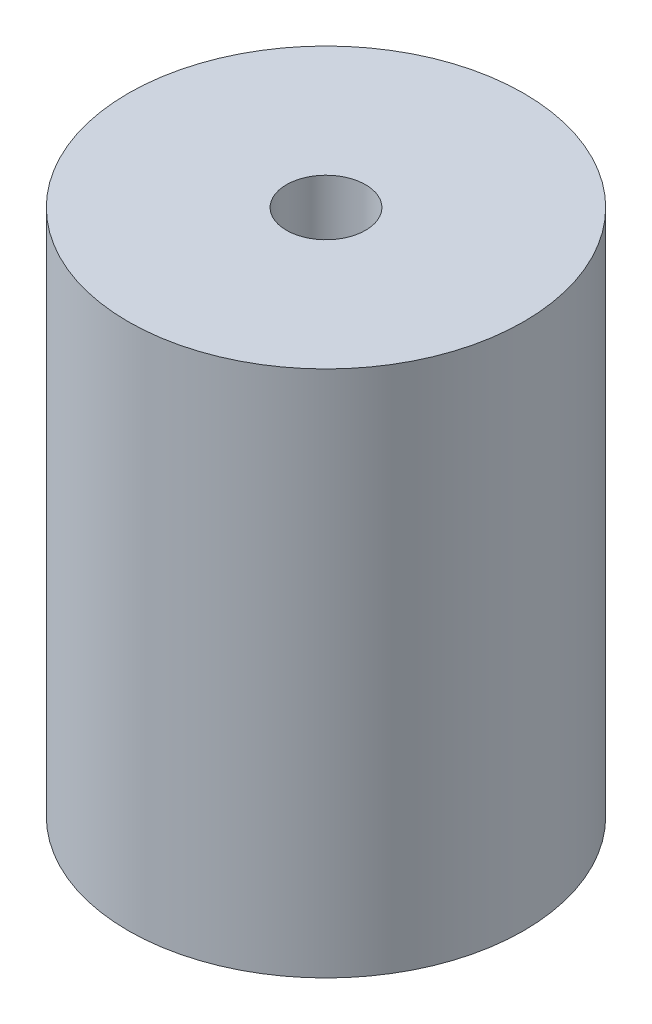
ISO-10303-21;
HEADER;
FILE_DESCRIPTION(('STEP AP214'),'2;1');
FILE_NAME('part.step','',(''),(''),'','','');
FILE_SCHEMA(('AUTOMOTIVE_DESIGN { 1 0 10303 214 1 1 1 1 }'));
ENDSEC;
DATA;
#1=APPLICATION_CONTEXT('core data for automotive mechanical design processes');
#2=APPLICATION_PROTOCOL_DEFINITION('international standard','automotive_design',2000,#1);
#3=PRODUCT_CONTEXT('',#1,'mechanical');
#4=PRODUCT('Part','Part','',(#3));
#5=PRODUCT_RELATED_PRODUCT_CATEGORY('part','',(#4));
#6=PRODUCT_DEFINITION_FORMATION('','',#4);
#7=PRODUCT_DEFINITION_CONTEXT('part definition',#1,'design');
#8=PRODUCT_DEFINITION('design','',#6,#7);
#9=PRODUCT_DEFINITION_SHAPE('','',#8);
#10=(LENGTH_UNIT() NAMED_UNIT(*) SI_UNIT(.MILLI.,.METRE.));
#11=(NAMED_UNIT(*) PLANE_ANGLE_UNIT() SI_UNIT($,.RADIAN.));
#12=(NAMED_UNIT(*) SI_UNIT($,.STERADIAN.) SOLID_ANGLE_UNIT());
#13=UNCERTAINTY_MEASURE_WITH_UNIT(LENGTH_MEASURE(1.E-05),#10,'distance_accuracy_value','');
#14=(GEOMETRIC_REPRESENTATION_CONTEXT(3) GLOBAL_UNCERTAINTY_ASSIGNED_CONTEXT((#13)) GLOBAL_UNIT_ASSIGNED_CONTEXT((#10,
#11,#12)) REPRESENTATION_CONTEXT('',''));
#15=CARTESIAN_POINT('',(0.,0.,0.));
#16=DIRECTION('',(0.,0.,1.));
#17=DIRECTION('',(1.,0.,0.));
#18=AXIS2_PLACEMENT_3D('',#15,#16,#17);
#19=CARTESIAN_POINT('',(0.,40.,0.));
#20=DIRECTION('',(0.,-1.,0.));
#21=DIRECTION('',(0.,0.,-1.));
#22=AXIS2_PLACEMENT_3D('',#19,#20,#21);
#23=CYLINDRICAL_SURFACE('',#22,15.);
#24=CARTESIAN_POINT('',(0.,40.,0.));
#25=DIRECTION('',(0.,1.,0.));
#26=DIRECTION('',(0.,0.,1.));
#27=AXIS2_PLACEMENT_3D('',#24,#25,#26);
#28=CIRCLE('',#27,15.);
#29=CARTESIAN_POINT('',(0.,40.,15.));
#30=VERTEX_POINT('',#29);
#31=EDGE_CURVE('E10',#30,#30,#28,.T.);
#32=ORIENTED_EDGE('',*,*,#31,.F.);
#33=EDGE_LOOP('',(#32));
#34=FACE_BOUND('',#33,.T.);
#35=CARTESIAN_POINT('',(0.,0.,0.));
#36=DIRECTION('',(0.,1.,0.));
#37=DIRECTION('',(0.,0.,1.));
#38=AXIS2_PLACEMENT_3D('',#35,#36,#37);
#39=CIRCLE('',#38,15.);
#40=CARTESIAN_POINT('',(0.,0.,15.));
#41=VERTEX_POINT('',#40);
#42=EDGE_CURVE('E32',#41,#41,#39,.T.);
#43=ORIENTED_EDGE('',*,*,#42,.T.);
#44=EDGE_LOOP('',(#43));
#45=FACE_BOUND('',#44,.T.);
#46=ADVANCED_FACE('F29',(#34,#45),#23,.T.);
#47=CARTESIAN_POINT('',(0.,40.,0.));
#48=DIRECTION('',(0.,1.,0.));
#49=DIRECTION('',(0.,0.,1.));
#50=AXIS2_PLACEMENT_3D('',#47,#48,#49);
#51=PLANE('',#50);
#52=CARTESIAN_POINT('',(0.,40.,0.));
#53=DIRECTION('',(0.,1.,0.));
#54=DIRECTION('',(0.,0.,1.));
#55=AXIS2_PLACEMENT_3D('',#52,#53,#54);
#56=CIRCLE('',#55,3.);
#57=CARTESIAN_POINT('',(0.,40.,3.));
#58=VERTEX_POINT('',#57);
#59=EDGE_CURVE('E39',#58,#58,#56,.T.);
#60=ORIENTED_EDGE('',*,*,#59,.F.);
#61=EDGE_LOOP('',(#60));
#62=FACE_BOUND('',#61,.T.);
#63=ORIENTED_EDGE('',*,*,#31,.T.);
#64=EDGE_LOOP('',(#63));
#65=FACE_BOUND('',#64,.T.);
#66=ADVANCED_FACE('F66',(#62,#65),#51,.T.);
#67=CARTESIAN_POINT('',(0.,0.,0.));
#68=DIRECTION('',(0.,1.,0.));
#69=DIRECTION('',(0.,0.,1.));
#70=AXIS2_PLACEMENT_3D('',#67,#68,#69);
#71=PLANE('',#70);
#72=CARTESIAN_POINT('',(0.,0.,0.));
#73=DIRECTION('',(0.,-1.,0.));
#74=DIRECTION('',(0.,0.,-1.));
#75=AXIS2_PLACEMENT_3D('',#72,#73,#74);
#76=CIRCLE('',#75,4.);
#77=CARTESIAN_POINT('',(0.,0.,-4.));
#78=VERTEX_POINT('',#77);
#79=EDGE_CURVE('E47',#78,#78,#76,.T.);
#80=ORIENTED_EDGE('',*,*,#79,.F.);
#81=EDGE_LOOP('',(#80));
#82=FACE_BOUND('',#81,.T.);
#83=ORIENTED_EDGE('',*,*,#42,.F.);
#84=EDGE_LOOP('',(#83));
#85=FACE_BOUND('',#84,.T.);
#86=ADVANCED_FACE('F62',(#82,#85),#71,.F.);
#87=CARTESIAN_POINT('',(0.,20.,0.));
#88=DIRECTION('',(0.,1.,0.));
#89=DIRECTION('',(0.,0.,1.));
#90=AXIS2_PLACEMENT_3D('',#87,#88,#89);
#91=CYLINDRICAL_SURFACE('',#90,3.);
#92=CARTESIAN_POINT('',(0.,20.,0.));
#93=DIRECTION('',(0.,-1.,0.));
#94=DIRECTION('',(0.,0.,-1.));
#95=AXIS2_PLACEMENT_3D('',#92,#93,#94);
#96=CIRCLE('',#95,3.);
#97=CARTESIAN_POINT('',(0.,20.,-3.));
#98=VERTEX_POINT('',#97);
#99=EDGE_CURVE('E43',#98,#98,#96,.F.);
#100=ORIENTED_EDGE('',*,*,#99,.F.);
#101=EDGE_LOOP('',(#100));
#102=FACE_BOUND('',#101,.T.);
#103=ORIENTED_EDGE('',*,*,#59,.T.);
#104=EDGE_LOOP('',(#103));
#105=FACE_BOUND('',#104,.T.);
#106=ADVANCED_FACE('F65',(#102,#105),#91,.F.);
#107=CARTESIAN_POINT('',(0.,20.,0.));
#108=DIRECTION('',(0.,-1.,0.));
#109=DIRECTION('',(0.,0.,-1.));
#110=AXIS2_PLACEMENT_3D('',#107,#108,#109);
#111=PLANE('',#110);
#112=CARTESIAN_POINT('',(0.,20.,0.));
#113=DIRECTION('',(0.,-1.,0.));
#114=DIRECTION('',(0.,0.,-1.));
#115=AXIS2_PLACEMENT_3D('',#112,#113,#114);
#116=CIRCLE('',#115,4.);
#117=CARTESIAN_POINT('',(0.,20.,-4.));
#118=VERTEX_POINT('',#117);
#119=EDGE_CURVE('E46',#118,#118,#116,.T.);
#120=ORIENTED_EDGE('',*,*,#119,.T.);
#121=EDGE_LOOP('',(#120));
#122=FACE_BOUND('',#121,.T.);
#123=ORIENTED_EDGE('',*,*,#99,.T.);
#124=EDGE_LOOP('',(#123));
#125=FACE_BOUND('',#124,.T.);
#126=ADVANCED_FACE('F53',(#122,#125),#111,.T.);
#127=CARTESIAN_POINT('',(0.,20.,0.));
#128=DIRECTION('',(0.,-1.,0.));
#129=DIRECTION('',(0.,0.,-1.));
#130=AXIS2_PLACEMENT_3D('',#127,#128,#129);
#131=CYLINDRICAL_SURFACE('',#130,4.);
#132=ORIENTED_EDGE('',*,*,#119,.F.);
#133=EDGE_LOOP('',(#132));
#134=FACE_BOUND('',#133,.T.);
#135=ORIENTED_EDGE('',*,*,#79,.T.);
#136=EDGE_LOOP('',(#135));
#137=FACE_BOUND('',#136,.T.);
#138=ADVANCED_FACE('F56',(#134,#137),#131,.F.);
#139=CLOSED_SHELL('',(#46,#66,#86,#106,#126,#138));
#140=MANIFOLD_SOLID_BREP('B2',#139);
#141=ADVANCED_BREP_SHAPE_REPRESENTATION('',(#18,#140),#14);
#142=SHAPE_DEFINITION_REPRESENTATION(#9,#141);
ENDSEC;
END-ISO-10303-21;
